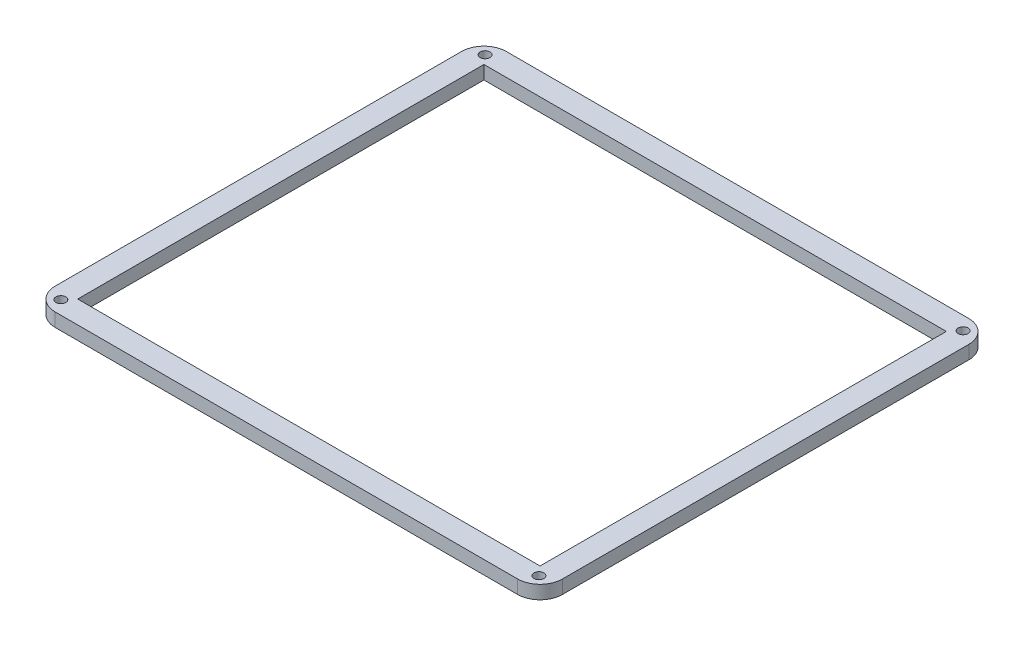
ISO-10303-21;
HEADER;
FILE_DESCRIPTION(('STEP AP214'),'2;1');
FILE_NAME('part.step','',(''),(''),'','','');
FILE_SCHEMA(('AUTOMOTIVE_DESIGN { 1 0 10303 214 1 1 1 1 }'));
ENDSEC;
DATA;
#1=APPLICATION_CONTEXT('core data for automotive mechanical design processes');
#2=APPLICATION_PROTOCOL_DEFINITION('international standard','automotive_design',2000,#1);
#3=PRODUCT_CONTEXT('',#1,'mechanical');
#4=PRODUCT('Part','Part','',(#3));
#5=PRODUCT_RELATED_PRODUCT_CATEGORY('part','',(#4));
#6=PRODUCT_DEFINITION_FORMATION('','',#4);
#7=PRODUCT_DEFINITION_CONTEXT('part definition',#1,'design');
#8=PRODUCT_DEFINITION('design','',#6,#7);
#9=PRODUCT_DEFINITION_SHAPE('','',#8);
#10=(LENGTH_UNIT() NAMED_UNIT(*) SI_UNIT(.MILLI.,.METRE.));
#11=(NAMED_UNIT(*) PLANE_ANGLE_UNIT() SI_UNIT($,.RADIAN.));
#12=(NAMED_UNIT(*) SI_UNIT($,.STERADIAN.) SOLID_ANGLE_UNIT());
#13=UNCERTAINTY_MEASURE_WITH_UNIT(LENGTH_MEASURE(1.E-05),#10,'distance_accuracy_value','');
#14=(GEOMETRIC_REPRESENTATION_CONTEXT(3) GLOBAL_UNCERTAINTY_ASSIGNED_CONTEXT((#13)) GLOBAL_UNIT_ASSIGNED_CONTEXT((#10,
#11,#12)) REPRESENTATION_CONTEXT('',''));
#15=CARTESIAN_POINT('',(0.,0.,0.));
#16=DIRECTION('',(0.,0.,1.));
#17=DIRECTION('',(1.,0.,0.));
#18=AXIS2_PLACEMENT_3D('',#15,#16,#17);
#19=CARTESIAN_POINT('',(-51.5,3.,45.25));
#20=DIRECTION('',(0.,-1.,0.));
#21=DIRECTION('',(0.,0.,-1.));
#22=AXIS2_PLACEMENT_3D('',#19,#20,#21);
#23=PLANE('',#22);
#24=CARTESIAN_POINT('',(-51.5,3.,45.25));
#25=DIRECTION('',(0.,1.,0.));
#26=DIRECTION('',(0.,0.,-1.));
#27=AXIS2_PLACEMENT_3D('',#24,#25,#26);
#28=CIRCLE('',#27,5.);
#29=CARTESIAN_POINT('',(-56.5,3.,45.25));
#30=VERTEX_POINT('',#29);
#31=CARTESIAN_POINT('',(-51.5,3.,50.25));
#32=VERTEX_POINT('',#31);
#33=EDGE_CURVE('E163',#30,#32,#28,.T.);
#34=ORIENTED_EDGE('',*,*,#33,.T.);
#35=DIRECTION('',(1.,0.,0.));
#36=VECTOR('',#35,1.);
#37=CARTESIAN_POINT('',(-51.5,3.,50.25));
#38=LINE('',#37,#36);
#39=CARTESIAN_POINT('',(51.4999999999999,3.,50.25));
#40=VERTEX_POINT('',#39);
#41=EDGE_CURVE('E166',#32,#40,#38,.T.);
#42=ORIENTED_EDGE('',*,*,#41,.T.);
#43=CARTESIAN_POINT('',(51.5,3.,45.25));
#44=DIRECTION('',(0.,1.,0.));
#45=DIRECTION('',(0.,0.,1.));
#46=AXIS2_PLACEMENT_3D('',#43,#44,#45);
#47=CIRCLE('',#46,5.);
#48=CARTESIAN_POINT('',(56.5,3.,45.25));
#49=VERTEX_POINT('',#48);
#50=EDGE_CURVE('E169',#40,#49,#47,.T.);
#51=ORIENTED_EDGE('',*,*,#50,.T.);
#52=DIRECTION('',(0.,0.,-1.));
#53=VECTOR('',#52,1.);
#54=CARTESIAN_POINT('',(56.5,3.,45.25));
#55=LINE('',#54,#53);
#56=CARTESIAN_POINT('',(56.5,3.,-45.2499999999999));
#57=VERTEX_POINT('',#56);
#58=EDGE_CURVE('E171',#49,#57,#55,.T.);
#59=ORIENTED_EDGE('',*,*,#58,.T.);
#60=CARTESIAN_POINT('',(51.5,3.,-45.25));
#61=DIRECTION('',(0.,1.,0.));
#62=DIRECTION('',(0.,0.,-1.));
#63=AXIS2_PLACEMENT_3D('',#60,#61,#62);
#64=CIRCLE('',#63,5.);
#65=CARTESIAN_POINT('',(51.4999999999999,3.,-50.25));
#66=VERTEX_POINT('',#65);
#67=EDGE_CURVE('E173',#57,#66,#64,.T.);
#68=ORIENTED_EDGE('',*,*,#67,.T.);
#69=DIRECTION('',(-1.,0.,0.));
#70=VECTOR('',#69,1.);
#71=CARTESIAN_POINT('',(-51.5,3.,-50.25));
#72=LINE('',#71,#70);
#73=CARTESIAN_POINT('',(-51.5,3.,-50.25));
#74=VERTEX_POINT('',#73);
#75=EDGE_CURVE('E175',#66,#74,#72,.T.);
#76=ORIENTED_EDGE('',*,*,#75,.T.);
#77=CARTESIAN_POINT('',(-51.5,3.,-45.25));
#78=DIRECTION('',(0.,1.,0.));
#79=DIRECTION('',(0.,0.,-1.));
#80=AXIS2_PLACEMENT_3D('',#77,#78,#79);
#81=CIRCLE('',#80,5.);
#82=CARTESIAN_POINT('',(-56.5,3.,-45.2499999999999));
#83=VERTEX_POINT('',#82);
#84=EDGE_CURVE('E177',#74,#83,#81,.T.);
#85=ORIENTED_EDGE('',*,*,#84,.T.);
#86=DIRECTION('',(0.,0.,1.));
#87=VECTOR('',#86,1.);
#88=CARTESIAN_POINT('',(-56.5,3.,45.25));
#89=LINE('',#88,#87);
#90=EDGE_CURVE('E179',#83,#30,#89,.T.);
#91=ORIENTED_EDGE('',*,*,#90,.T.);
#92=EDGE_LOOP('',(#34,#42,#51,#59,#68,#76,#85,#91));
#93=FACE_BOUND('',#92,.T.);
#94=DIRECTION('',(0.,0.,-1.));
#95=VECTOR('',#94,1.);
#96=CARTESIAN_POINT('',(51.5,3.,45.25));
#97=LINE('',#96,#95);
#98=CARTESIAN_POINT('',(51.5,3.,45.25));
#99=VERTEX_POINT('',#98);
#100=CARTESIAN_POINT('',(51.5,3.,-45.25));
#101=VERTEX_POINT('',#100);
#102=EDGE_CURVE('E124',#99,#101,#97,.T.);
#103=ORIENTED_EDGE('',*,*,#102,.F.);
#104=DIRECTION('',(1.,0.,0.));
#105=VECTOR('',#104,1.);
#106=CARTESIAN_POINT('',(-51.5,3.,45.25));
#107=LINE('',#106,#105);
#108=CARTESIAN_POINT('',(-51.5,3.,45.25));
#109=VERTEX_POINT('',#108);
#110=EDGE_CURVE('E147',#109,#99,#107,.T.);
#111=ORIENTED_EDGE('',*,*,#110,.F.);
#112=DIRECTION('',(0.,0.,1.));
#113=VECTOR('',#112,1.);
#114=CARTESIAN_POINT('',(-51.5,3.,45.25));
#115=LINE('',#114,#113);
#116=CARTESIAN_POINT('',(-51.5,3.,-45.25));
#117=VERTEX_POINT('',#116);
#118=EDGE_CURVE('E145',#117,#109,#115,.T.);
#119=ORIENTED_EDGE('',*,*,#118,.F.);
#120=DIRECTION('',(-1.,0.,0.));
#121=VECTOR('',#120,1.);
#122=CARTESIAN_POINT('',(-51.5,3.,-45.25));
#123=LINE('',#122,#121);
#124=EDGE_CURVE('E132',#101,#117,#123,.T.);
#125=ORIENTED_EDGE('',*,*,#124,.F.);
#126=EDGE_LOOP('',(#103,#111,#119,#125));
#127=FACE_BOUND('',#126,.T.);
#128=CARTESIAN_POINT('',(-53.25,3.,-47.25));
#129=DIRECTION('',(0.,1.,0.));
#130=DIRECTION('',(0.,0.,1.));
#131=AXIS2_PLACEMENT_3D('',#128,#129,#130);
#132=CIRCLE('',#131,1.1);
#133=CARTESIAN_POINT('',(-53.25,3.,-46.15));
#134=VERTEX_POINT('',#133);
#135=EDGE_CURVE('E153',#134,#134,#132,.T.);
#136=ORIENTED_EDGE('',*,*,#135,.F.);
#137=EDGE_LOOP('',(#136));
#138=FACE_BOUND('',#137,.T.);
#139=CARTESIAN_POINT('',(53.25,3.,-47.25));
#140=DIRECTION('',(0.,1.,0.));
#141=DIRECTION('',(0.,0.,1.));
#142=AXIS2_PLACEMENT_3D('',#139,#140,#141);
#143=CIRCLE('',#142,1.1);
#144=CARTESIAN_POINT('',(53.25,3.,-46.15));
#145=VERTEX_POINT('',#144);
#146=EDGE_CURVE('E325',#145,#145,#143,.T.);
#147=ORIENTED_EDGE('',*,*,#146,.F.);
#148=EDGE_LOOP('',(#147));
#149=FACE_BOUND('',#148,.T.);
#150=CARTESIAN_POINT('',(53.25,3.,47.25));
#151=DIRECTION('',(0.,1.,0.));
#152=DIRECTION('',(0.,0.,-1.));
#153=AXIS2_PLACEMENT_3D('',#150,#151,#152);
#154=CIRCLE('',#153,1.1);
#155=CARTESIAN_POINT('',(53.25,3.,46.15));
#156=VERTEX_POINT('',#155);
#157=EDGE_CURVE('E319',#156,#156,#154,.T.);
#158=ORIENTED_EDGE('',*,*,#157,.F.);
#159=EDGE_LOOP('',(#158));
#160=FACE_BOUND('',#159,.T.);
#161=CARTESIAN_POINT('',(-53.25,3.,47.25));
#162=DIRECTION('',(0.,1.,0.));
#163=DIRECTION('',(0.,0.,-1.));
#164=AXIS2_PLACEMENT_3D('',#161,#162,#163);
#165=CIRCLE('',#164,1.10000000000001);
#166=CARTESIAN_POINT('',(-53.25,3.,46.15));
#167=VERTEX_POINT('',#166);
#168=EDGE_CURVE('E310',#167,#167,#165,.T.);
#169=ORIENTED_EDGE('',*,*,#168,.F.);
#170=EDGE_LOOP('',(#169));
#171=FACE_BOUND('',#170,.T.);
#172=ADVANCED_FACE('F35',(#93,#127,#138,#149,#160,#171),#23,.F.);
#173=CARTESIAN_POINT('',(-51.5,0.,45.25));
#174=DIRECTION('',(0.,-1.,0.));
#175=DIRECTION('',(0.,0.,-1.));
#176=AXIS2_PLACEMENT_3D('',#173,#174,#175);
#177=PLANE('',#176);
#178=CARTESIAN_POINT('',(53.25,0.,47.25));
#179=DIRECTION('',(0.,1.,0.));
#180=DIRECTION('',(0.,0.,-1.));
#181=AXIS2_PLACEMENT_3D('',#178,#179,#180);
#182=CIRCLE('',#181,1.1);
#183=CARTESIAN_POINT('',(53.25,0.,46.15));
#184=VERTEX_POINT('',#183);
#185=EDGE_CURVE('E316',#184,#184,#182,.T.);
#186=ORIENTED_EDGE('',*,*,#185,.T.);
#187=EDGE_LOOP('',(#186));
#188=FACE_BOUND('',#187,.T.);
#189=CARTESIAN_POINT('',(-53.25,0.,-47.25));
#190=DIRECTION('',(0.,1.,0.));
#191=DIRECTION('',(0.,0.,1.));
#192=AXIS2_PLACEMENT_3D('',#189,#190,#191);
#193=CIRCLE('',#192,1.1);
#194=CARTESIAN_POINT('',(-53.25,0.,-46.15));
#195=VERTEX_POINT('',#194);
#196=EDGE_CURVE('E328',#195,#195,#193,.T.);
#197=ORIENTED_EDGE('',*,*,#196,.T.);
#198=EDGE_LOOP('',(#197));
#199=FACE_BOUND('',#198,.T.);
#200=CARTESIAN_POINT('',(-51.5,0.,45.25));
#201=DIRECTION('',(0.,1.,0.));
#202=DIRECTION('',(0.,0.,-1.));
#203=AXIS2_PLACEMENT_3D('',#200,#201,#202);
#204=CIRCLE('',#203,5.);
#205=CARTESIAN_POINT('',(-56.5,0.,45.25));
#206=VERTEX_POINT('',#205);
#207=CARTESIAN_POINT('',(-51.5,0.,50.25));
#208=VERTEX_POINT('',#207);
#209=EDGE_CURVE('E140',#206,#208,#204,.T.);
#210=ORIENTED_EDGE('',*,*,#209,.F.);
#211=DIRECTION('',(0.,0.,1.));
#212=VECTOR('',#211,1.);
#213=CARTESIAN_POINT('',(-56.5,0.,45.25));
#214=LINE('',#213,#212);
#215=CARTESIAN_POINT('',(-56.5,0.,-45.2499999999999));
#216=VERTEX_POINT('',#215);
#217=EDGE_CURVE('E167',#216,#206,#214,.T.);
#218=ORIENTED_EDGE('',*,*,#217,.F.);
#219=CARTESIAN_POINT('',(-51.5,0.,-45.25));
#220=DIRECTION('',(0.,1.,0.));
#221=DIRECTION('',(0.,0.,-1.));
#222=AXIS2_PLACEMENT_3D('',#219,#220,#221);
#223=CIRCLE('',#222,5.);
#224=CARTESIAN_POINT('',(-51.5,0.,-50.25));
#225=VERTEX_POINT('',#224);
#226=EDGE_CURVE('E194',#225,#216,#223,.T.);
#227=ORIENTED_EDGE('',*,*,#226,.F.);
#228=DIRECTION('',(-1.,0.,0.));
#229=VECTOR('',#228,1.);
#230=CARTESIAN_POINT('',(-51.5,0.,-50.25));
#231=LINE('',#230,#229);
#232=CARTESIAN_POINT('',(51.4999999999999,0.,-50.25));
#233=VERTEX_POINT('',#232);
#234=EDGE_CURVE('E192',#233,#225,#231,.T.);
#235=ORIENTED_EDGE('',*,*,#234,.F.);
#236=CARTESIAN_POINT('',(51.5,0.,-45.25));
#237=DIRECTION('',(0.,1.,0.));
#238=DIRECTION('',(0.,0.,-1.));
#239=AXIS2_PLACEMENT_3D('',#236,#237,#238);
#240=CIRCLE('',#239,5.);
#241=CARTESIAN_POINT('',(56.5,0.,-45.2499999999999));
#242=VERTEX_POINT('',#241);
#243=EDGE_CURVE('E190',#242,#233,#240,.T.);
#244=ORIENTED_EDGE('',*,*,#243,.F.);
#245=DIRECTION('',(0.,0.,-1.));
#246=VECTOR('',#245,1.);
#247=CARTESIAN_POINT('',(56.5,0.,45.25));
#248=LINE('',#247,#246);
#249=CARTESIAN_POINT('',(56.5,0.,45.25));
#250=VERTEX_POINT('',#249);
#251=EDGE_CURVE('E188',#250,#242,#248,.T.);
#252=ORIENTED_EDGE('',*,*,#251,.F.);
#253=CARTESIAN_POINT('',(51.5,0.,45.25));
#254=DIRECTION('',(0.,1.,0.));
#255=DIRECTION('',(0.,0.,1.));
#256=AXIS2_PLACEMENT_3D('',#253,#254,#255);
#257=CIRCLE('',#256,5.);
#258=CARTESIAN_POINT('',(51.4999999999999,0.,50.25));
#259=VERTEX_POINT('',#258);
#260=EDGE_CURVE('E186',#259,#250,#257,.T.);
#261=ORIENTED_EDGE('',*,*,#260,.F.);
#262=DIRECTION('',(1.,0.,0.));
#263=VECTOR('',#262,1.);
#264=CARTESIAN_POINT('',(-51.5,0.,50.25));
#265=LINE('',#264,#263);
#266=EDGE_CURVE('E184',#208,#259,#265,.T.);
#267=ORIENTED_EDGE('',*,*,#266,.F.);
#268=EDGE_LOOP('',(#210,#218,#227,#235,#244,#252,#261,#267));
#269=FACE_BOUND('',#268,.T.);
#270=DIRECTION('',(1.,0.,0.));
#271=VECTOR('',#270,1.);
#272=CARTESIAN_POINT('',(-51.5,0.,45.25));
#273=LINE('',#272,#271);
#274=CARTESIAN_POINT('',(-51.5,0.,45.25));
#275=VERTEX_POINT('',#274);
#276=CARTESIAN_POINT('',(51.5,0.,45.25));
#277=VERTEX_POINT('',#276);
#278=EDGE_CURVE('E133',#275,#277,#273,.T.);
#279=ORIENTED_EDGE('',*,*,#278,.T.);
#280=DIRECTION('',(0.,0.,-1.));
#281=VECTOR('',#280,1.);
#282=CARTESIAN_POINT('',(51.5,0.,45.25));
#283=LINE('',#282,#281);
#284=CARTESIAN_POINT('',(51.5,0.,-45.25));
#285=VERTEX_POINT('',#284);
#286=EDGE_CURVE('E58',#277,#285,#283,.T.);
#287=ORIENTED_EDGE('',*,*,#286,.T.);
#288=DIRECTION('',(-1.,0.,0.));
#289=VECTOR('',#288,1.);
#290=CARTESIAN_POINT('',(-51.5,0.,-45.25));
#291=LINE('',#290,#289);
#292=CARTESIAN_POINT('',(-51.5,0.,-45.25));
#293=VERTEX_POINT('',#292);
#294=EDGE_CURVE('E139',#285,#293,#291,.T.);
#295=ORIENTED_EDGE('',*,*,#294,.T.);
#296=DIRECTION('',(0.,0.,1.));
#297=VECTOR('',#296,1.);
#298=CARTESIAN_POINT('',(-51.5,0.,45.25));
#299=LINE('',#298,#297);
#300=EDGE_CURVE('E155',#293,#275,#299,.T.);
#301=ORIENTED_EDGE('',*,*,#300,.T.);
#302=EDGE_LOOP('',(#279,#287,#295,#301));
#303=FACE_BOUND('',#302,.T.);
#304=CARTESIAN_POINT('',(53.25,0.,-47.25));
#305=DIRECTION('',(0.,1.,0.));
#306=DIRECTION('',(0.,0.,1.));
#307=AXIS2_PLACEMENT_3D('',#304,#305,#306);
#308=CIRCLE('',#307,1.1);
#309=CARTESIAN_POINT('',(53.25,0.,-46.15));
#310=VERTEX_POINT('',#309);
#311=EDGE_CURVE('E322',#310,#310,#308,.T.);
#312=ORIENTED_EDGE('',*,*,#311,.T.);
#313=EDGE_LOOP('',(#312));
#314=FACE_BOUND('',#313,.T.);
#315=CARTESIAN_POINT('',(-53.25,0.,47.25));
#316=DIRECTION('',(0.,1.,0.));
#317=DIRECTION('',(0.,0.,-1.));
#318=AXIS2_PLACEMENT_3D('',#315,#316,#317);
#319=CIRCLE('',#318,1.10000000000001);
#320=CARTESIAN_POINT('',(-53.25,0.,46.15));
#321=VERTEX_POINT('',#320);
#322=EDGE_CURVE('E313',#321,#321,#319,.T.);
#323=ORIENTED_EDGE('',*,*,#322,.T.);
#324=EDGE_LOOP('',(#323));
#325=FACE_BOUND('',#324,.T.);
#326=ADVANCED_FACE('F224',(#188,#199,#269,#303,#314,#325),#177,.T.);
#327=CARTESIAN_POINT('',(-51.5,3.,45.25));
#328=DIRECTION('',(0.,-1.,0.));
#329=DIRECTION('',(0.,0.,-1.));
#330=AXIS2_PLACEMENT_3D('',#327,#328,#329);
#331=CYLINDRICAL_SURFACE('',#330,5.);
#332=ORIENTED_EDGE('',*,*,#209,.T.);
#333=DIRECTION('',(0.,-1.,0.));
#334=VECTOR('',#333,1.);
#335=CARTESIAN_POINT('',(-51.5,3.,50.25));
#336=LINE('',#335,#334);
#337=EDGE_CURVE('E11',#32,#208,#336,.T.);
#338=ORIENTED_EDGE('',*,*,#337,.F.);
#339=ORIENTED_EDGE('',*,*,#33,.F.);
#340=DIRECTION('',(0.,-1.,0.));
#341=VECTOR('',#340,1.);
#342=CARTESIAN_POINT('',(-56.5,3.,45.25));
#343=LINE('',#342,#341);
#344=EDGE_CURVE('E181',#30,#206,#343,.T.);
#345=ORIENTED_EDGE('',*,*,#344,.T.);
#346=EDGE_LOOP('',(#332,#338,#339,#345));
#347=FACE_BOUND('',#346,.T.);
#348=ADVANCED_FACE('F37',(#347),#331,.T.);
#349=CARTESIAN_POINT('',(-51.5,3.,50.25));
#350=DIRECTION('',(0.,0.,-1.));
#351=DIRECTION('',(-1.,0.,0.));
#352=AXIS2_PLACEMENT_3D('',#349,#350,#351);
#353=PLANE('',#352);
#354=ORIENTED_EDGE('',*,*,#266,.T.);
#355=DIRECTION('',(0.,-1.,0.));
#356=VECTOR('',#355,1.);
#357=CARTESIAN_POINT('',(51.4999999999999,3.,50.25));
#358=LINE('',#357,#356);
#359=EDGE_CURVE('E43',#40,#259,#358,.T.);
#360=ORIENTED_EDGE('',*,*,#359,.F.);
#361=ORIENTED_EDGE('',*,*,#41,.F.);
#362=ORIENTED_EDGE('',*,*,#337,.T.);
#363=EDGE_LOOP('',(#354,#360,#361,#362));
#364=FACE_BOUND('',#363,.T.);
#365=ADVANCED_FACE('F241',(#364),#353,.F.);
#366=CARTESIAN_POINT('',(51.5,3.,45.25));
#367=DIRECTION('',(0.,-1.,0.));
#368=DIRECTION('',(0.,0.,-1.));
#369=AXIS2_PLACEMENT_3D('',#366,#367,#368);
#370=CYLINDRICAL_SURFACE('',#369,5.);
#371=ORIENTED_EDGE('',*,*,#260,.T.);
#372=DIRECTION('',(0.,-1.,0.));
#373=VECTOR('',#372,1.);
#374=CARTESIAN_POINT('',(56.5,3.,45.25));
#375=LINE('',#374,#373);
#376=EDGE_CURVE('E211',#49,#250,#375,.T.);
#377=ORIENTED_EDGE('',*,*,#376,.F.);
#378=ORIENTED_EDGE('',*,*,#50,.F.);
#379=ORIENTED_EDGE('',*,*,#359,.T.);
#380=EDGE_LOOP('',(#371,#377,#378,#379));
#381=FACE_BOUND('',#380,.T.);
#382=ADVANCED_FACE('F218',(#381),#370,.T.);
#383=CARTESIAN_POINT('',(56.5,3.,45.25));
#384=DIRECTION('',(-1.,0.,0.));
#385=DIRECTION('',(0.,0.,1.));
#386=AXIS2_PLACEMENT_3D('',#383,#384,#385);
#387=PLANE('',#386);
#388=ORIENTED_EDGE('',*,*,#251,.T.);
#389=DIRECTION('',(0.,-1.,0.));
#390=VECTOR('',#389,1.);
#391=CARTESIAN_POINT('',(56.5,3.,-45.2499999999999));
#392=LINE('',#391,#390);
#393=EDGE_CURVE('E208',#57,#242,#392,.T.);
#394=ORIENTED_EDGE('',*,*,#393,.F.);
#395=ORIENTED_EDGE('',*,*,#58,.F.);
#396=ORIENTED_EDGE('',*,*,#376,.T.);
#397=EDGE_LOOP('',(#388,#394,#395,#396));
#398=FACE_BOUND('',#397,.T.);
#399=ADVANCED_FACE('F230',(#398),#387,.F.);
#400=CARTESIAN_POINT('',(51.5,3.,-45.25));
#401=DIRECTION('',(0.,-1.,0.));
#402=DIRECTION('',(0.,0.,-1.));
#403=AXIS2_PLACEMENT_3D('',#400,#401,#402);
#404=CYLINDRICAL_SURFACE('',#403,5.);
#405=ORIENTED_EDGE('',*,*,#243,.T.);
#406=DIRECTION('',(0.,-1.,0.));
#407=VECTOR('',#406,1.);
#408=CARTESIAN_POINT('',(51.4999999999999,3.,-50.25));
#409=LINE('',#408,#407);
#410=EDGE_CURVE('E205',#66,#233,#409,.T.);
#411=ORIENTED_EDGE('',*,*,#410,.F.);
#412=ORIENTED_EDGE('',*,*,#67,.F.);
#413=ORIENTED_EDGE('',*,*,#393,.T.);
#414=EDGE_LOOP('',(#405,#411,#412,#413));
#415=FACE_BOUND('',#414,.T.);
#416=ADVANCED_FACE('F234',(#415),#404,.T.);
#417=CARTESIAN_POINT('',(-51.5,3.,-50.25));
#418=DIRECTION('',(0.,0.,1.));
#419=DIRECTION('',(1.,0.,0.));
#420=AXIS2_PLACEMENT_3D('',#417,#418,#419);
#421=PLANE('',#420);
#422=ORIENTED_EDGE('',*,*,#234,.T.);
#423=DIRECTION('',(0.,-1.,0.));
#424=VECTOR('',#423,1.);
#425=CARTESIAN_POINT('',(-51.5,3.,-50.25));
#426=LINE('',#425,#424);
#427=EDGE_CURVE('E202',#74,#225,#426,.T.);
#428=ORIENTED_EDGE('',*,*,#427,.F.);
#429=ORIENTED_EDGE('',*,*,#75,.F.);
#430=ORIENTED_EDGE('',*,*,#410,.T.);
#431=EDGE_LOOP('',(#422,#428,#429,#430));
#432=FACE_BOUND('',#431,.T.);
#433=ADVANCED_FACE('F254',(#432),#421,.F.);
#434=CARTESIAN_POINT('',(-51.5,3.,-45.25));
#435=DIRECTION('',(0.,-1.,0.));
#436=DIRECTION('',(0.,0.,-1.));
#437=AXIS2_PLACEMENT_3D('',#434,#435,#436);
#438=CYLINDRICAL_SURFACE('',#437,5.);
#439=ORIENTED_EDGE('',*,*,#226,.T.);
#440=DIRECTION('',(0.,-1.,0.));
#441=VECTOR('',#440,1.);
#442=CARTESIAN_POINT('',(-56.5,3.,-45.2499999999999));
#443=LINE('',#442,#441);
#444=EDGE_CURVE('E199',#83,#216,#443,.T.);
#445=ORIENTED_EDGE('',*,*,#444,.F.);
#446=ORIENTED_EDGE('',*,*,#84,.F.);
#447=ORIENTED_EDGE('',*,*,#427,.T.);
#448=EDGE_LOOP('',(#439,#445,#446,#447));
#449=FACE_BOUND('',#448,.T.);
#450=ADVANCED_FACE('F252',(#449),#438,.T.);
#451=CARTESIAN_POINT('',(-56.5,3.,45.25));
#452=DIRECTION('',(1.,0.,0.));
#453=DIRECTION('',(0.,0.,-1.));
#454=AXIS2_PLACEMENT_3D('',#451,#452,#453);
#455=PLANE('',#454);
#456=ORIENTED_EDGE('',*,*,#217,.T.);
#457=ORIENTED_EDGE('',*,*,#344,.F.);
#458=ORIENTED_EDGE('',*,*,#90,.F.);
#459=ORIENTED_EDGE('',*,*,#444,.T.);
#460=EDGE_LOOP('',(#456,#457,#458,#459));
#461=FACE_BOUND('',#460,.T.);
#462=ADVANCED_FACE('F247',(#461),#455,.F.);
#463=CARTESIAN_POINT('',(51.5,3.,45.25));
#464=DIRECTION('',(-1.,0.,0.));
#465=DIRECTION('',(0.,0.,1.));
#466=AXIS2_PLACEMENT_3D('',#463,#464,#465);
#467=PLANE('',#466);
#468=ORIENTED_EDGE('',*,*,#286,.F.);
#469=DIRECTION('',(0.,-1.,0.));
#470=VECTOR('',#469,1.);
#471=CARTESIAN_POINT('',(51.5,3.,45.25));
#472=LINE('',#471,#470);
#473=EDGE_CURVE('E128',#99,#277,#472,.T.);
#474=ORIENTED_EDGE('',*,*,#473,.F.);
#475=ORIENTED_EDGE('',*,*,#102,.T.);
#476=DIRECTION('',(0.,-1.,0.));
#477=VECTOR('',#476,1.);
#478=CARTESIAN_POINT('',(51.5,3.,-45.25));
#479=LINE('',#478,#477);
#480=EDGE_CURVE('E127',#101,#285,#479,.T.);
#481=ORIENTED_EDGE('',*,*,#480,.T.);
#482=EDGE_LOOP('',(#468,#474,#475,#481));
#483=FACE_BOUND('',#482,.T.);
#484=ADVANCED_FACE('F126',(#483),#467,.T.);
#485=CARTESIAN_POINT('',(-51.5,3.,-45.25));
#486=DIRECTION('',(0.,0.,1.));
#487=DIRECTION('',(1.,0.,0.));
#488=AXIS2_PLACEMENT_3D('',#485,#486,#487);
#489=PLANE('',#488);
#490=ORIENTED_EDGE('',*,*,#294,.F.);
#491=ORIENTED_EDGE('',*,*,#480,.F.);
#492=ORIENTED_EDGE('',*,*,#124,.T.);
#493=DIRECTION('',(0.,-1.,0.));
#494=VECTOR('',#493,1.);
#495=CARTESIAN_POINT('',(-51.5,3.,-45.25));
#496=LINE('',#495,#494);
#497=EDGE_CURVE('E141',#117,#293,#496,.T.);
#498=ORIENTED_EDGE('',*,*,#497,.T.);
#499=EDGE_LOOP('',(#490,#491,#492,#498));
#500=FACE_BOUND('',#499,.T.);
#501=ADVANCED_FACE('F136',(#500),#489,.T.);
#502=CARTESIAN_POINT('',(-51.5,3.,45.25));
#503=DIRECTION('',(1.,0.,0.));
#504=DIRECTION('',(0.,0.,-1.));
#505=AXIS2_PLACEMENT_3D('',#502,#503,#504);
#506=PLANE('',#505);
#507=ORIENTED_EDGE('',*,*,#300,.F.);
#508=ORIENTED_EDGE('',*,*,#497,.F.);
#509=ORIENTED_EDGE('',*,*,#118,.T.);
#510=DIRECTION('',(0.,-1.,0.));
#511=VECTOR('',#510,1.);
#512=CARTESIAN_POINT('',(-51.5,3.,45.25));
#513=LINE('',#512,#511);
#514=EDGE_CURVE('E50',#109,#275,#513,.T.);
#515=ORIENTED_EDGE('',*,*,#514,.T.);
#516=EDGE_LOOP('',(#507,#508,#509,#515));
#517=FACE_BOUND('',#516,.T.);
#518=ADVANCED_FACE('F280',(#517),#506,.T.);
#519=CARTESIAN_POINT('',(-51.5,3.,45.25));
#520=DIRECTION('',(0.,0.,-1.));
#521=DIRECTION('',(-1.,0.,0.));
#522=AXIS2_PLACEMENT_3D('',#519,#520,#521);
#523=PLANE('',#522);
#524=ORIENTED_EDGE('',*,*,#278,.F.);
#525=ORIENTED_EDGE('',*,*,#514,.F.);
#526=ORIENTED_EDGE('',*,*,#110,.T.);
#527=ORIENTED_EDGE('',*,*,#473,.T.);
#528=EDGE_LOOP('',(#524,#525,#526,#527));
#529=FACE_BOUND('',#528,.T.);
#530=ADVANCED_FACE('F284',(#529),#523,.T.);
#531=CARTESIAN_POINT('',(-53.25,3.,-47.25));
#532=DIRECTION('',(0.,-1.,0.));
#533=DIRECTION('',(0.,0.,-1.));
#534=AXIS2_PLACEMENT_3D('',#531,#532,#533);
#535=CYLINDRICAL_SURFACE('',#534,1.1);
#536=ORIENTED_EDGE('',*,*,#135,.T.);
#537=EDGE_LOOP('',(#536));
#538=FACE_BOUND('',#537,.T.);
#539=ORIENTED_EDGE('',*,*,#196,.F.);
#540=EDGE_LOOP('',(#539));
#541=FACE_BOUND('',#540,.T.);
#542=ADVANCED_FACE('F290',(#538,#541),#535,.F.);
#543=CARTESIAN_POINT('',(53.25,3.,-47.25));
#544=DIRECTION('',(0.,-1.,0.));
#545=DIRECTION('',(0.,0.,-1.));
#546=AXIS2_PLACEMENT_3D('',#543,#544,#545);
#547=CYLINDRICAL_SURFACE('',#546,1.1);
#548=ORIENTED_EDGE('',*,*,#146,.T.);
#549=EDGE_LOOP('',(#548));
#550=FACE_BOUND('',#549,.T.);
#551=ORIENTED_EDGE('',*,*,#311,.F.);
#552=EDGE_LOOP('',(#551));
#553=FACE_BOUND('',#552,.T.);
#554=ADVANCED_FACE('F293',(#550,#553),#547,.F.);
#555=CARTESIAN_POINT('',(53.25,3.,47.25));
#556=DIRECTION('',(0.,-1.,0.));
#557=DIRECTION('',(0.,0.,-1.));
#558=AXIS2_PLACEMENT_3D('',#555,#556,#557);
#559=CYLINDRICAL_SURFACE('',#558,1.1);
#560=ORIENTED_EDGE('',*,*,#157,.T.);
#561=EDGE_LOOP('',(#560));
#562=FACE_BOUND('',#561,.T.);
#563=ORIENTED_EDGE('',*,*,#185,.F.);
#564=EDGE_LOOP('',(#563));
#565=FACE_BOUND('',#564,.T.);
#566=ADVANCED_FACE('F297',(#562,#565),#559,.F.);
#567=CARTESIAN_POINT('',(-53.25,3.,47.25));
#568=DIRECTION('',(0.,-1.,0.));
#569=DIRECTION('',(0.,0.,-1.));
#570=AXIS2_PLACEMENT_3D('',#567,#568,#569);
#571=CYLINDRICAL_SURFACE('',#570,1.10000000000001);
#572=ORIENTED_EDGE('',*,*,#168,.T.);
#573=EDGE_LOOP('',(#572));
#574=FACE_BOUND('',#573,.T.);
#575=ORIENTED_EDGE('',*,*,#322,.F.);
#576=EDGE_LOOP('',(#575));
#577=FACE_BOUND('',#576,.T.);
#578=ADVANCED_FACE('F301',(#574,#577),#571,.F.);
#579=CLOSED_SHELL('',(#172,#326,#348,#365,#382,#399,#416,#433,#450,#462,#484,#501,#518,#530,
#542,#554,#566,#578));
#580=MANIFOLD_SOLID_BREP('B2',#579);
#581=ADVANCED_BREP_SHAPE_REPRESENTATION('',(#18,#580),#14);
#582=SHAPE_DEFINITION_REPRESENTATION(#9,#581);
ENDSEC;
END-ISO-10303-21;
